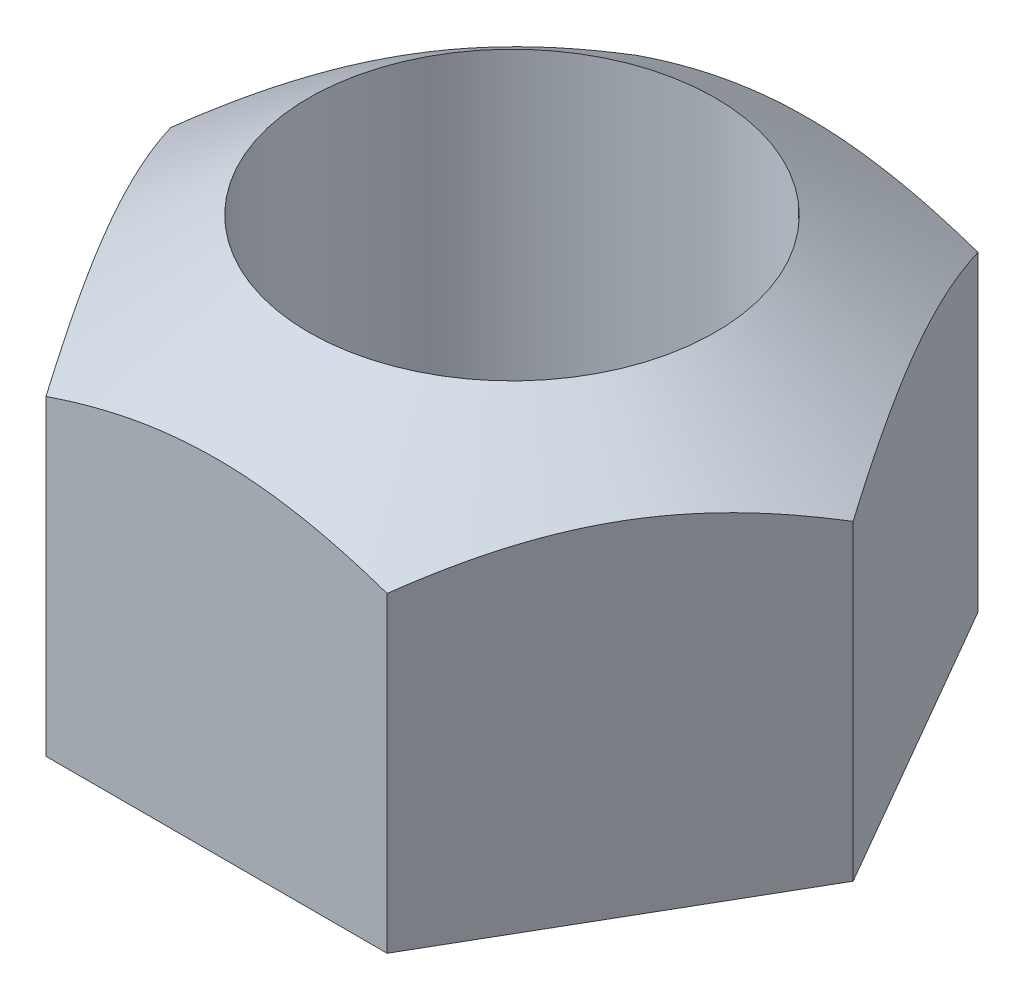
ISO-10303-21;
HEADER;
FILE_DESCRIPTION(('STEP AP214'),'2;1');
FILE_NAME('part.step','',(''),(''),'','','');
FILE_SCHEMA(('AUTOMOTIVE_DESIGN { 1 0 10303 214 1 1 1 1 }'));
ENDSEC;
DATA;
#1=APPLICATION_CONTEXT('core data for automotive mechanical design processes');
#2=APPLICATION_PROTOCOL_DEFINITION('international standard','automotive_design',2000,#1);
#3=PRODUCT_CONTEXT('',#1,'mechanical');
#4=PRODUCT('Part','Part','',(#3));
#5=PRODUCT_RELATED_PRODUCT_CATEGORY('part','',(#4));
#6=PRODUCT_DEFINITION_FORMATION('','',#4);
#7=PRODUCT_DEFINITION_CONTEXT('part definition',#1,'design');
#8=PRODUCT_DEFINITION('design','',#6,#7);
#9=PRODUCT_DEFINITION_SHAPE('','',#8);
#10=(LENGTH_UNIT() NAMED_UNIT(*) SI_UNIT(.MILLI.,.METRE.));
#11=(NAMED_UNIT(*) PLANE_ANGLE_UNIT() SI_UNIT($,.RADIAN.));
#12=(NAMED_UNIT(*) SI_UNIT($,.STERADIAN.) SOLID_ANGLE_UNIT());
#13=UNCERTAINTY_MEASURE_WITH_UNIT(LENGTH_MEASURE(1.E-05),#10,'distance_accuracy_value','');
#14=(GEOMETRIC_REPRESENTATION_CONTEXT(3) GLOBAL_UNCERTAINTY_ASSIGNED_CONTEXT((#13)) GLOBAL_UNIT_ASSIGNED_CONTEXT((#10,
#11,#12)) REPRESENTATION_CONTEXT('',''));
#15=CARTESIAN_POINT('',(0.,0.,0.));
#16=DIRECTION('',(0.,0.,1.));
#17=DIRECTION('',(1.,0.,0.));
#18=AXIS2_PLACEMENT_3D('',#15,#16,#17);
#19=CARTESIAN_POINT('',(0.730411307380375,2.31008644566849,1.26511069012455));
#20=DIRECTION('',(-0.866025403784442,0.,-0.499999999999995));
#21=DIRECTION('',(-0.499999999999995,0.,0.866025403784442));
#22=AXIS2_PLACEMENT_3D('',#19,#20,#21);
#23=PLANE('',#22);
#24=CARTESIAN_POINT('',(0.730344334749149,1.90459442003512,1.26522669012455));
#25=CARTESIAN_POINT('',(0.762994849035526,1.92700671426747,1.20867434048729));
#26=CARTESIAN_POINT('',(0.796043354908079,1.94743841424387,1.15143264920179));
#27=CARTESIAN_POINT('',(0.862961564355046,1.983056341439,1.0355269104881));
#28=CARTESIAN_POINT('',(0.896833844074278,1.99822297281167,0.976858401046209));
#29=CARTESIAN_POINT('',(0.963984480609225,2.021427267074,0.860550086807088));
#30=CARTESIAN_POINT('',(0.997242011803791,2.0296962717228,0.802946353043791));
#31=CARTESIAN_POINT('',(1.06395417871489,2.03904799498006,0.687397490470748));
#32=CARTESIAN_POINT('',(1.09740831219659,2.04014450705557,0.629453231557254));
#33=CARTESIAN_POINT('',(1.15852067768774,2.03549590271579,0.523603509555858));
#34=CARTESIAN_POINT('',(1.186202315196,2.03087642950622,0.475657506954846));
#35=CARTESIAN_POINT('',(1.2412759293787,2.01700190697536,0.38026720903396));
#36=CARTESIAN_POINT('',(1.26866783154976,2.00774569358291,0.332823042757741));
#37=CARTESIAN_POINT('',(1.32386692363268,1.98488627164974,0.237215410738445));
#38=CARTESIAN_POINT('',(1.35166076296746,1.97115749351571,0.189075068873205));
#39=CARTESIAN_POINT('',(1.40668476888355,1.94026109875597,0.093770694990564));
#40=CARTESIAN_POINT('',(1.43391631770764,1.92310340762198,0.0466042688584459));
#41=CARTESIAN_POINT('',(1.46089027750967,1.90459442003512,-0.000115999999999781));
#42=B_SPLINE_CURVE_WITH_KNOTS('',3,(#24,#25,#26,#27,#28,#29,#30,#31,#32,#33,#34,#35,#36,#37,#38,
#39,#40,#41),.UNSPECIFIED.,.F.,.F.,(4,2,2,2,2,2,2,2,4),(0.,0.207256785975081,0.415276884264073,
0.616002323096558,0.816341631759163,0.9828011365583,1.14930245260552,1.3209524248478,
1.4921125460658),.UNSPECIFIED.);
#43=CARTESIAN_POINT('',(0.730411307380375,1.90464038238119,1.26511069012455));
#44=VERTEX_POINT('',#43);
#45=CARTESIAN_POINT('',(1.46082330487845,1.90464038238119,0.));
#46=VERTEX_POINT('',#45);
#47=EDGE_CURVE('E87',#44,#46,#42,.T.);
#48=ORIENTED_EDGE('',*,*,#47,.F.);
#49=DIRECTION('',(0.,-1.,0.));
#50=VECTOR('',#49,1.);
#51=CARTESIAN_POINT('',(0.730411307380375,2.31008644566849,1.26511069012455));
#52=LINE('',#51,#50);
#53=CARTESIAN_POINT('',(0.730411307380375,0.570086445668492,1.26511069012455));
#54=VERTEX_POINT('',#53);
#55=EDGE_CURVE('E57',#44,#54,#52,.T.);
#56=ORIENTED_EDGE('',*,*,#55,.T.);
#57=DIRECTION('',(0.499999999999995,0.,-0.866025403784441));
#58=VECTOR('',#57,1.);
#59=CARTESIAN_POINT('',(0.730411307380375,0.570086445668492,1.26511069012455));
#60=LINE('',#59,#58);
#61=CARTESIAN_POINT('',(1.46082330487845,0.570086445668492,0.));
#62=VERTEX_POINT('',#61);
#63=EDGE_CURVE('E127',#54,#62,#60,.T.);
#64=ORIENTED_EDGE('',*,*,#63,.T.);
#65=DIRECTION('',(0.,-1.,0.));
#66=VECTOR('',#65,1.);
#67=CARTESIAN_POINT('',(1.46082330487845,2.31008644566849,0.));
#68=LINE('',#67,#66);
#69=EDGE_CURVE('E11',#46,#62,#68,.T.);
#70=ORIENTED_EDGE('',*,*,#69,.F.);
#71=EDGE_LOOP('',(#48,#56,#64,#70));
#72=FACE_BOUND('',#71,.T.);
#73=ADVANCED_FACE('F34',(#72),#23,.F.);
#74=CARTESIAN_POINT('',(1.46082330487845,2.31008644566849,0.));
#75=DIRECTION('',(-0.866025403784438,0.,0.500000000000001));
#76=DIRECTION('',(0.500000000000001,0.,0.866025403784438));
#77=AXIS2_PLACEMENT_3D('',#74,#75,#76);
#78=PLANE('',#77);
#79=CARTESIAN_POINT('',(1.46089027750967,1.90459442003512,0.000116000000000267));
#80=CARTESIAN_POINT('',(1.42823976322329,1.92700671426747,-0.0564363496372581));
#81=CARTESIAN_POINT('',(1.39519125735074,1.94743841424387,-0.113678040922759));
#82=CARTESIAN_POINT('',(1.32827304790377,1.983056341439,-0.229583779636442));
#83=CARTESIAN_POINT('',(1.29440076818454,1.99822297281167,-0.288252289078337));
#84=CARTESIAN_POINT('',(1.22725013164959,2.021427267074,-0.404560603317457));
#85=CARTESIAN_POINT('',(1.19399260045503,2.02969627172281,-0.462164337080754));
#86=CARTESIAN_POINT('',(1.12728043354393,2.03904799498006,-0.577713199653796));
#87=CARTESIAN_POINT('',(1.09382630006223,2.04014450705557,-0.635657458567289));
#88=CARTESIAN_POINT('',(1.03271393457107,2.03549590271579,-0.741507180568686));
#89=CARTESIAN_POINT('',(1.00503229706281,2.03087642950622,-0.789453183169699));
#90=CARTESIAN_POINT('',(0.949958682880108,2.01700190697536,-0.884843481090588));
#91=CARTESIAN_POINT('',(0.922566780709055,2.00774569358291,-0.932287647366807));
#92=CARTESIAN_POINT('',(0.86736768862613,1.98488627164974,-1.02789527938611));
#93=CARTESIAN_POINT('',(0.839573849291352,1.97115749351571,-1.07603562125135));
#94=CARTESIAN_POINT('',(0.784549843375259,1.94026109875597,-1.17133999513399));
#95=CARTESIAN_POINT('',(0.757318294551168,1.92310340762198,-1.21850642126611));
#96=CARTESIAN_POINT('',(0.730344334749132,1.90459442003512,-1.26522669012456));
#97=B_SPLINE_CURVE_WITH_KNOTS('',3,(#79,#80,#81,#82,#83,#84,#85,#86,#87,#88,#89,#90,#91,#92,#93,
#94,#95,#96),.UNSPECIFIED.,.F.,.F.,(4,2,2,2,2,2,2,2,4),(0.,0.207256785975081,0.415276884264073,
0.616002323096558,0.816341631759162,0.982801136558304,1.14930245260553,1.32095242484782,
1.49211254606581),.UNSPECIFIED.);
#98=CARTESIAN_POINT('',(0.730411307380358,1.90464038238119,-1.26511069012456));
#99=VERTEX_POINT('',#98);
#100=EDGE_CURVE('E95',#46,#99,#97,.T.);
#101=ORIENTED_EDGE('',*,*,#100,.F.);
#102=ORIENTED_EDGE('',*,*,#69,.T.);
#103=DIRECTION('',(-0.500000000000001,0.,-0.866025403784438));
#104=VECTOR('',#103,1.);
#105=CARTESIAN_POINT('',(1.46082330487845,0.570086445668492,0.));
#106=LINE('',#105,#104);
#107=CARTESIAN_POINT('',(0.730411307380358,0.570086445668492,-1.26511069012456));
#108=VERTEX_POINT('',#107);
#109=EDGE_CURVE('E124',#62,#108,#106,.T.);
#110=ORIENTED_EDGE('',*,*,#109,.T.);
#111=DIRECTION('',(0.,-1.,0.));
#112=VECTOR('',#111,1.);
#113=CARTESIAN_POINT('',(0.730411307380358,2.31008644566849,-1.26511069012456));
#114=LINE('',#113,#112);
#115=EDGE_CURVE('E42',#99,#108,#114,.T.);
#116=ORIENTED_EDGE('',*,*,#115,.F.);
#117=EDGE_LOOP('',(#101,#102,#110,#116));
#118=FACE_BOUND('',#117,.T.);
#119=ADVANCED_FACE('F125',(#118),#78,.F.);
#120=CARTESIAN_POINT('',(0.730411307380358,2.31008644566849,-1.26511069012456));
#121=DIRECTION('',(0.,0.,1.));
#122=DIRECTION('',(1.,0.,0.));
#123=AXIS2_PLACEMENT_3D('',#120,#121,#122);
#124=PLANE('',#123);
#125=CARTESIAN_POINT('',(-1.71363681046105,1.44540139064842,-1.26511069012455));
#126=CARTESIAN_POINT('',(-1.6666089797108,1.47135820230091,-1.26511069012455));
#127=CARTESIAN_POINT('',(-1.61942523065414,1.49703694142713,-1.26511069012455));
#128=CARTESIAN_POINT('',(-1.52467279271376,1.54769703594125,-1.26511069012455));
#129=CARTESIAN_POINT('',(-1.47710402667997,1.57267824685973,-1.26511069012455));
#130=CARTESIAN_POINT('',(-1.38122425928571,1.62194719808813,-1.26511069012455));
#131=CARTESIAN_POINT('',(-1.3329104627545,1.64622952705724,-1.26511069012455));
#132=CARTESIAN_POINT('',(-1.23576265994052,1.69372158184219,-1.26511069012455));
#133=CARTESIAN_POINT('',(-1.18692868319917,1.71693136817311,-1.26511069012455));
#134=CARTESIAN_POINT('',(-1.03628357482214,1.78607701873522,-1.26511069012455));
#135=CARTESIAN_POINT('',(-0.933470956989689,1.82987509258553,-1.26511069012455));
#136=CARTESIAN_POINT('',(-0.724576630891701,1.90842346007959,-1.26511069012455));
#137=CARTESIAN_POINT('',(-0.618504317680191,1.94319744579488,-1.26511069012455));
#138=CARTESIAN_POINT('',(-0.451817153443067,1.98599678211792,-1.26511069012455));
#139=CARTESIAN_POINT('',(-0.392494446163903,1.99899217293489,-1.26511069012455));
#140=CARTESIAN_POINT('',(-0.272940169228112,2.0198568455114,-1.26511069012455));
#141=CARTESIAN_POINT('',(-0.212708770947646,2.02772708179281,-1.26511069012455));
#142=CARTESIAN_POINT('',(-0.0926609144173519,2.03756601528617,-1.26511069012455));
#143=CARTESIAN_POINT('',(-0.0328517499757665,2.03962132561417,-1.26511069012455));
#144=CARTESIAN_POINT('',(0.0866838660549695,2.03787842201897,-1.26511069012455));
#145=CARTESIAN_POINT('',(0.146410306561648,2.03407948784457,-1.26511069012455));
#146=CARTESIAN_POINT('',(0.27789263138173,2.01958907772609,-1.26511069012456));
#147=CARTESIAN_POINT('',(0.349504148305075,2.00760306060661,-1.26511069012456));
#148=CARTESIAN_POINT('',(0.491288746248722,1.97693307888654,-1.26511069012456));
#149=CARTESIAN_POINT('',(0.561460475884036,1.9582431010076,-1.26511069012456));
#150=CARTESIAN_POINT('',(0.701850522374415,1.91525494889421,-1.26511069012456));
#151=CARTESIAN_POINT('',(0.772030676011676,1.89083457090076,-1.26511069012456));
#152=CARTESIAN_POINT('',(0.876146089892861,1.85126365136414,-1.26511069012456));
#153=CARTESIAN_POINT('',(0.910655681776702,1.83758465961976,-1.26511069012456));
#154=CARTESIAN_POINT('',(0.979333669314093,1.80938048431248,-1.26511069012456));
#155=CARTESIAN_POINT('',(1.01350201769018,1.79485518535227,-1.26511069012456));
#156=CARTESIAN_POINT('',(1.10642372986043,1.75418926740721,-1.26511069012456));
#157=CARTESIAN_POINT('',(1.1648623524846,1.72733028170191,-1.26511069012456));
#158=CARTESIAN_POINT('',(1.28095334020165,1.67195830549759,-1.26511069012456));
#159=CARTESIAN_POINT('',(1.33860559895701,1.64344509398858,-1.26511069012456));
#160=CARTESIAN_POINT('',(1.51063708262007,1.5559820193895,-1.26511069012456));
#161=CARTESIAN_POINT('',(1.62404645796107,1.49512894306785,-1.26511069012456));
#162=CARTESIAN_POINT('',(1.84933809110043,1.37015521457951,-1.26511069012456));
#163=CARTESIAN_POINT('',(1.96121660048732,1.30602790682887,-1.26511069012456));
#164=CARTESIAN_POINT('',(2.18375399972391,1.17567964078263,-1.26511069012456));
#165=CARTESIAN_POINT('',(2.29441280516911,1.10945853880634,-1.26511069012456));
#166=CARTESIAN_POINT('',(2.50270849347165,0.982954302664846,-1.26511069012456));
#167=CARTESIAN_POINT('',(2.60043671055914,0.9228208717716,-1.26511069012456));
#168=CARTESIAN_POINT('',(2.79537326080928,0.801702652016759,-1.26511069012456));
#169=CARTESIAN_POINT('',(2.89258155636159,0.740717802686764,-1.26511069012456));
#170=CARTESIAN_POINT('',(3.08612860935584,0.618400508381204,-1.26511069012457));
#171=CARTESIAN_POINT('',(3.1824693020151,0.557071120194004,-1.26511069012457));
#172=CARTESIAN_POINT('',(3.37482010905709,0.433917232566977,-1.26511069012457));
#173=CARTESIAN_POINT('',(3.47083025594729,0.372092783925148,-1.26511069012457));
#174=CARTESIAN_POINT('',(3.5667204835218,0.310084337105674,-1.26511069012457));
#175=B_SPLINE_CURVE_WITH_KNOTS('',3,(#125,#126,#127,#128,#129,#130,#131,#132,#133,#134,#135,
#136,#137,#138,#139,#140,#141,#142,#143,#144,#145,#146,#147,#148,#149,#150,#151,#152,#153,#154,
#155,#156,#157,#158,#159,#160,#161,#162,#163,#164,#165,#166,#167,#168,#169,#170,#171,#172,#173,
#174),.UNSPECIFIED.,.F.,.F.,(4,2,2,2,2,2,2,2,2,2,2,2,2,2,2,2,2,2,2,2,2,2,2,2,4),(0.,
0.161149087075127,0.322331306828059,0.484537113022617,0.646733756026832,0.981766587550142,
1.31591070697251,1.49791679776368,1.67988898157347,1.85913605247545,2.03840517801243,
2.25581728968302,2.47342490403572,2.696180027428,2.80753739742604,2.91890998713689,
3.11181935700755,3.30475455982076,3.69077161173963,4.07760725341118,4.46446949844381,
4.80870508313862,5.15296524135169,5.49557914250136,5.83815832748947),.UNSPECIFIED.);
#176=CARTESIAN_POINT('',(-0.730412687615816,1.90464038238119,-1.26511069012455));
#177=VERTEX_POINT('',#176);
#178=EDGE_CURVE('E121',#99,#177,#175,.F.);
#179=ORIENTED_EDGE('',*,*,#178,.F.);
#180=ORIENTED_EDGE('',*,*,#115,.T.);
#181=DIRECTION('',(-1.,0.,0.));
#182=VECTOR('',#181,1.);
#183=CARTESIAN_POINT('',(0.730411307380358,0.570086445668492,-1.26511069012456));
#184=LINE('',#183,#182);
#185=CARTESIAN_POINT('',(-0.730412687615816,0.570086445668492,-1.26511069012455));
#186=VERTEX_POINT('',#185);
#187=EDGE_CURVE('E119',#108,#186,#184,.T.);
#188=ORIENTED_EDGE('',*,*,#187,.T.);
#189=DIRECTION('',(0.,-1.,0.));
#190=VECTOR('',#189,1.);
#191=CARTESIAN_POINT('',(-0.730412687615816,2.31008644566849,-1.26511069012455));
#192=LINE('',#191,#190);
#193=EDGE_CURVE('E110',#177,#186,#192,.T.);
#194=ORIENTED_EDGE('',*,*,#193,.F.);
#195=EDGE_LOOP('',(#179,#180,#188,#194));
#196=FACE_BOUND('',#195,.T.);
#197=ADVANCED_FACE('F116',(#196),#124,.F.);
#198=CARTESIAN_POINT('',(-0.730412687615816,2.31008644566849,-1.26511069012455));
#199=DIRECTION('',(0.866025403784441,0.,0.499999999999995));
#200=DIRECTION('',(0.499999999999995,0.,-0.866025403784442));
#201=AXIS2_PLACEMENT_3D('',#198,#199,#200);
#202=PLANE('',#201);
#203=CARTESIAN_POINT('',(-0.73034571498459,1.90459442003512,-1.26522669012455));
#204=CARTESIAN_POINT('',(-0.762996229270966,1.92700671426747,-1.20867434048729));
#205=CARTESIAN_POINT('',(-0.796044735143519,1.94743841424387,-1.15143264920179));
#206=CARTESIAN_POINT('',(-0.862962944590486,1.98305634143901,-1.03552691048811));
#207=CARTESIAN_POINT('',(-0.896835224309718,1.99822297281167,-0.976858401046214));
#208=CARTESIAN_POINT('',(-0.963985860844665,2.021427267074,-0.860550086807093));
#209=CARTESIAN_POINT('',(-0.997243392039232,2.02969627172281,-0.802946353043796));
#210=CARTESIAN_POINT('',(-1.06395555895033,2.03904799498006,-0.687397490470753));
#211=CARTESIAN_POINT('',(-1.09740969243203,2.04014450705557,-0.629453231557259));
#212=CARTESIAN_POINT('',(-1.15852205792318,2.03549590271579,-0.523603509555862));
#213=CARTESIAN_POINT('',(-1.18620369543144,2.03087642950622,-0.475657506954849));
#214=CARTESIAN_POINT('',(-1.24127730961415,2.01700190697536,-0.38026720903396));
#215=CARTESIAN_POINT('',(-1.2686692117852,2.00774569358291,-0.33282304275774));
#216=CARTESIAN_POINT('',(-1.32386830386812,1.98488627164974,-0.237215410738441));
#217=CARTESIAN_POINT('',(-1.3516621432029,1.97115749351571,-0.1890750688732));
#218=CARTESIAN_POINT('',(-1.40668614911899,1.94026109875597,-0.0937706949905561));
#219=CARTESIAN_POINT('',(-1.43391769794309,1.92310340762198,-0.0466042688584367));
#220=CARTESIAN_POINT('',(-1.46089165774512,1.90459442003512,0.000116000000010308));
#221=B_SPLINE_CURVE_WITH_KNOTS('',3,(#203,#204,#205,#206,#207,#208,#209,#210,#211,#212,#213,
#214,#215,#216,#217,#218,#219,#220),.UNSPECIFIED.,.F.,.F.,(4,2,2,2,2,2,2,2,4),(0.,
0.207256785975081,0.415276884264073,0.616002323096558,0.816341631759163,0.982801136558305,
1.14930245260553,1.32095242484782,1.49211254606581),.UNSPECIFIED.);
#222=CARTESIAN_POINT('',(-1.4608246851139,1.90464038238119,0.));
#223=VERTEX_POINT('',#222);
#224=EDGE_CURVE('E178',#177,#223,#221,.T.);
#225=ORIENTED_EDGE('',*,*,#224,.F.);
#226=ORIENTED_EDGE('',*,*,#193,.T.);
#227=DIRECTION('',(-0.499999999999995,0.,0.866025403784442));
#228=VECTOR('',#227,1.);
#229=CARTESIAN_POINT('',(-0.730412687615816,0.570086445668492,-1.26511069012455));
#230=LINE('',#229,#228);
#231=CARTESIAN_POINT('',(-1.4608246851139,0.570086445668492,0.));
#232=VERTEX_POINT('',#231);
#233=EDGE_CURVE('E133',#186,#232,#230,.T.);
#234=ORIENTED_EDGE('',*,*,#233,.T.);
#235=DIRECTION('',(0.,-1.,0.));
#236=VECTOR('',#235,1.);
#237=CARTESIAN_POINT('',(-1.4608246851139,2.31008644566849,0.));
#238=LINE('',#237,#236);
#239=EDGE_CURVE('E103',#223,#232,#238,.T.);
#240=ORIENTED_EDGE('',*,*,#239,.F.);
#241=EDGE_LOOP('',(#225,#226,#234,#240));
#242=FACE_BOUND('',#241,.T.);
#243=ADVANCED_FACE('F191',(#242),#202,.F.);
#244=CARTESIAN_POINT('',(-1.4608246851139,2.31008644566849,0.));
#245=DIRECTION('',(0.866025403784434,0.,-0.500000000000007));
#246=DIRECTION('',(-0.500000000000007,0.,-0.866025403784435));
#247=AXIS2_PLACEMENT_3D('',#244,#245,#246);
#248=PLANE('',#247);
#249=CARTESIAN_POINT('',(-1.46089165774512,1.90459442003512,-0.000115999999989534));
#250=CARTESIAN_POINT('',(-1.42824114345874,1.92700671426747,0.0564363496372685));
#251=CARTESIAN_POINT('',(-1.39519263758619,1.94743841424387,0.113678040922769));
#252=CARTESIAN_POINT('',(-1.32827442813922,1.983056341439,0.229583779636451));
#253=CARTESIAN_POINT('',(-1.29440214841999,1.99822297281167,0.288252289078346));
#254=CARTESIAN_POINT('',(-1.22725151188504,2.021427267074,0.404560603317466));
#255=CARTESIAN_POINT('',(-1.19399398069047,2.02969627172281,0.462164337080763));
#256=CARTESIAN_POINT('',(-1.12728181377937,2.03904799498006,0.577713199653804));
#257=CARTESIAN_POINT('',(-1.09382768029767,2.04014450705557,0.635657458567297));
#258=CARTESIAN_POINT('',(-1.03271531480652,2.03549590271579,0.741507180568694));
#259=CARTESIAN_POINT('',(-1.00503367729826,2.03087642950622,0.789453183169707));
#260=CARTESIAN_POINT('',(-0.949960063115551,2.01700190697536,0.884843481090595));
#261=CARTESIAN_POINT('',(-0.922568160944498,2.00774569358291,0.932287647366814));
#262=CARTESIAN_POINT('',(-0.867369068861572,1.98488627164974,1.02789527938611));
#263=CARTESIAN_POINT('',(-0.839575229526794,1.97115749351571,1.07603562125135));
#264=CARTESIAN_POINT('',(-0.784551223610701,1.94026109875597,1.171339995134));
#265=CARTESIAN_POINT('',(-0.757319674786609,1.92310340762198,1.21850642126612));
#266=CARTESIAN_POINT('',(-0.730345714984572,1.90459442003512,1.26522669012456));
#267=B_SPLINE_CURVE_WITH_KNOTS('',3,(#249,#250,#251,#252,#253,#254,#255,#256,#257,#258,#259,
#260,#261,#262,#263,#264,#265,#266),.UNSPECIFIED.,.F.,.F.,(4,2,2,2,2,2,2,2,4),(0.,
0.207256785975081,0.415276884264073,0.616002323096558,0.816341631759162,0.982801136558304,
1.14930245260553,1.32095242484782,1.49211254606581),.UNSPECIFIED.);
#268=CARTESIAN_POINT('',(-0.730412687615798,1.90464038238119,1.26511069012456));
#269=VERTEX_POINT('',#268);
#270=EDGE_CURVE('E49',#223,#269,#267,.T.);
#271=ORIENTED_EDGE('',*,*,#270,.F.);
#272=ORIENTED_EDGE('',*,*,#239,.T.);
#273=DIRECTION('',(0.500000000000007,0.,0.866025403784434));
#274=VECTOR('',#273,1.);
#275=CARTESIAN_POINT('',(-1.4608246851139,0.570086445668492,0.));
#276=LINE('',#275,#274);
#277=CARTESIAN_POINT('',(-0.730412687615798,0.570086445668492,1.26511069012456));
#278=VERTEX_POINT('',#277);
#279=EDGE_CURVE('E105',#232,#278,#276,.T.);
#280=ORIENTED_EDGE('',*,*,#279,.T.);
#281=DIRECTION('',(0.,-1.,0.));
#282=VECTOR('',#281,1.);
#283=CARTESIAN_POINT('',(-0.730412687615798,2.31008644566849,1.26511069012456));
#284=LINE('',#283,#282);
#285=EDGE_CURVE('E101',#269,#278,#284,.T.);
#286=ORIENTED_EDGE('',*,*,#285,.F.);
#287=EDGE_LOOP('',(#271,#272,#280,#286));
#288=FACE_BOUND('',#287,.T.);
#289=ADVANCED_FACE('F139',(#288),#248,.F.);
#290=CARTESIAN_POINT('',(-0.730412687615798,2.31008644566849,1.26511069012456));
#291=DIRECTION('',(0.,0.,-1.));
#292=DIRECTION('',(-1.,0.,0.));
#293=AXIS2_PLACEMENT_3D('',#290,#291,#292);
#294=PLANE('',#293);
#295=CARTESIAN_POINT('',(-1.71363681103067,1.44540139033393,1.26511069012457));
#296=CARTESIAN_POINT('',(-1.66660898026274,1.47135820199923,1.26511069012457));
#297=CARTESIAN_POINT('',(-1.61942523118838,1.49703694113823,1.26511069012457));
#298=CARTESIAN_POINT('',(-1.52467279321251,1.54769703567787,1.26511069012457));
#299=CARTESIAN_POINT('',(-1.47710402716094,1.57267824660907,1.26511069012457));
#300=CARTESIAN_POINT('',(-1.38122425973066,1.62194719786299,1.26511069012457));
#301=CARTESIAN_POINT('',(-1.33291046318121,1.6462295268449,1.26511069012457));
#302=CARTESIAN_POINT('',(-1.23576266033056,1.69372158165521,1.26511069012457));
#303=CARTESIAN_POINT('',(-1.18692868357078,1.7169313679987,1.26511069012457));
#304=CARTESIAN_POINT('',(-1.03628357513285,1.78607701860064,1.26511069012457));
#305=CARTESIAN_POINT('',(-0.933470957257395,1.82987509247742,1.26511069012456));
#306=CARTESIAN_POINT('',(-0.724576631071095,1.90842346001951,1.26511069012456));
#307=CARTESIAN_POINT('',(-0.618504317814295,1.94319744575638,1.26511069012456));
#308=CARTESIAN_POINT('',(-0.451817153549077,1.9859967820929,1.26511069012456));
#309=CARTESIAN_POINT('',(-0.392494446289105,1.99899217290879,1.26511069012456));
#310=CARTESIAN_POINT('',(-0.272940169391996,2.01985684548703,1.26511069012456));
#311=CARTESIAN_POINT('',(-0.21270877113102,2.02772708177126,1.26511069012456));
#312=CARTESIAN_POINT('',(-0.0926609146393876,2.03756601527437,1.26511069012456));
#313=CARTESIAN_POINT('',(-0.0328517502169801,2.03962132560927,1.26511069012456));
#314=CARTESIAN_POINT('',(0.0866838657762762,2.03787842203146,1.26511069012455));
#315=CARTESIAN_POINT('',(0.146410306264653,2.03407948786755,1.26511069012455));
#316=CARTESIAN_POINT('',(0.277892631041122,2.01958907777545,1.26511069012455));
#317=CARTESIAN_POINT('',(0.349504147939494,2.00760306067293,1.26511069012455));
#318=CARTESIAN_POINT('',(0.491288745834858,1.9769330789889,1.26511069012455));
#319=CARTESIAN_POINT('',(0.561460475446864,1.95824310112907,1.26511069012455));
#320=CARTESIAN_POINT('',(0.701850521891027,1.91525494905495,1.26511069012455));
#321=CARTESIAN_POINT('',(0.772030675505412,1.89083457108167,1.26511069012455));
#322=CARTESIAN_POINT('',(0.876146089352739,1.85126365157516,1.26511069012455));
#323=CARTESIAN_POINT('',(0.910655681225381,1.83758465984079,1.26511069012455));
#324=CARTESIAN_POINT('',(0.979333668740466,1.80938048455345,1.26511069012454));
#325=CARTESIAN_POINT('',(1.01350201710545,1.79485518560316,1.26511069012454));
#326=CARTESIAN_POINT('',(1.10642372926946,1.75418926767456,1.26511069012454));
#327=CARTESIAN_POINT('',(1.16486235189817,1.7273302819748,1.26511069012454));
#328=CARTESIAN_POINT('',(1.28095333962379,1.67195830578001,1.26511069012454));
#329=CARTESIAN_POINT('',(1.33860559838317,1.64344509427501,1.26511069012454));
#330=CARTESIAN_POINT('',(1.51063708205769,1.55598201968622,1.26511069012454));
#331=CARTESIAN_POINT('',(1.62404645740546,1.49512894336919,1.26511069012454));
#332=CARTESIAN_POINT('',(1.84933809055759,1.37015521488747,1.26511069012454));
#333=CARTESIAN_POINT('',(1.96121659995046,1.3060279071388,1.26511069012453));
#334=CARTESIAN_POINT('',(2.18375399919825,1.17567964109508,1.26511069012453));
#335=CARTESIAN_POINT('',(2.29441280464867,1.10945853911932,1.26511069012453));
#336=CARTESIAN_POINT('',(2.5027084929568,0.982954302980295,1.26511069012453));
#337=CARTESIAN_POINT('',(2.60043671004475,0.922820872089133,1.26511069012453));
#338=CARTESIAN_POINT('',(2.79537326029556,0.801702652338033,1.26511069012453));
#339=CARTESIAN_POINT('',(2.8925815558481,0.740717803009697,1.26511069012453));
#340=CARTESIAN_POINT('',(3.08612860884188,0.618400508707619,1.26511069012452));
#341=CARTESIAN_POINT('',(3.18246930150046,0.55707112052225,1.26511069012452));
#342=CARTESIAN_POINT('',(3.37482010854095,0.43391723289869,1.26511069012452));
#343=CARTESIAN_POINT('',(3.47083025543033,0.372092784258498,1.26511069012452));
#344=CARTESIAN_POINT('',(3.56672048300398,0.310084337440595,1.26511069012452));
#345=B_SPLINE_CURVE_WITH_KNOTS('',3,(#295,#296,#297,#298,#299,#300,#301,#302,#303,#304,#305,
#306,#307,#308,#309,#310,#311,#312,#313,#314,#315,#316,#317,#318,#319,#320,#321,#322,#323,#324,
#325,#326,#327,#328,#329,#330,#331,#332,#333,#334,#335,#336,#337,#338,#339,#340,#341,#342,#343,
#344),.UNSPECIFIED.,.F.,.F.,(4,2,2,2,2,2,2,2,2,2,2,2,2,2,2,2,2,2,2,2,2,2,2,2,4),(0.,
0.161149087140106,0.32233130695803,0.484537113218708,0.646733756289036,0.981766587962143,
1.31591070753301,1.49791679826746,1.67988898202066,1.85913605286616,2.03840517834656,
2.2558172899351,2.4734249042055,2.69618002751303,2.80753739746876,2.91890998713729,
3.11181935701333,3.30475455983199,3.69077161176207,4.07760725344619,4.46446949849143,
4.80870508318411,5.1529652413951,5.4955791425401,5.83815832752348),.UNSPECIFIED.);
#346=EDGE_CURVE('E85',#269,#44,#345,.T.);
#347=ORIENTED_EDGE('',*,*,#346,.F.);
#348=ORIENTED_EDGE('',*,*,#285,.T.);
#349=DIRECTION('',(1.,0.,0.));
#350=VECTOR('',#349,1.);
#351=CARTESIAN_POINT('',(-0.730412687615798,0.570086445668492,1.26511069012456));
#352=LINE('',#351,#350);
#353=EDGE_CURVE('E99',#278,#54,#352,.T.);
#354=ORIENTED_EDGE('',*,*,#353,.T.);
#355=ORIENTED_EDGE('',*,*,#55,.F.);
#356=EDGE_LOOP('',(#347,#348,#354,#355));
#357=FACE_BOUND('',#356,.T.);
#358=ADVANCED_FACE('F97',(#357),#294,.F.);
#359=CARTESIAN_POINT('',(-6.90117724671566E-07,0.570086445668492,0.));
#360=DIRECTION('',(0.,1.,0.));
#361=DIRECTION('',(0.,0.,1.));
#362=AXIS2_PLACEMENT_3D('',#359,#360,#361);
#363=PLANE('',#362);
#364=ORIENTED_EDGE('',*,*,#63,.F.);
#365=ORIENTED_EDGE('',*,*,#353,.F.);
#366=ORIENTED_EDGE('',*,*,#279,.F.);
#367=ORIENTED_EDGE('',*,*,#233,.F.);
#368=ORIENTED_EDGE('',*,*,#187,.F.);
#369=ORIENTED_EDGE('',*,*,#109,.F.);
#370=EDGE_LOOP('',(#364,#365,#366,#367,#368,#369));
#371=FACE_BOUND('',#370,.T.);
#372=CARTESIAN_POINT('',(-6.90117724671566E-07,0.570086445668492,0.));
#373=DIRECTION('',(0.,1.,0.));
#374=DIRECTION('',(0.,0.,1.));
#375=AXIS2_PLACEMENT_3D('',#372,#373,#374);
#376=CIRCLE('',#375,0.87);
#377=CARTESIAN_POINT('',(-6.90117724671566E-07,0.570086445668492,0.87));
#378=VERTEX_POINT('',#377);
#379=EDGE_CURVE('E94',#378,#378,#376,.T.);
#380=ORIENTED_EDGE('',*,*,#379,.T.);
#381=EDGE_LOOP('',(#380));
#382=FACE_BOUND('',#381,.T.);
#383=ADVANCED_FACE('F129',(#371,#382),#363,.F.);
#384=CARTESIAN_POINT('',(-6.90117724671566E-07,2.31008644566849,0.));
#385=DIRECTION('',(0.,-1.,0.));
#386=DIRECTION('',(0.,0.,-1.));
#387=AXIS2_PLACEMENT_3D('',#384,#385,#386);
#388=CYLINDRICAL_SURFACE('',#387,0.87);
#389=CARTESIAN_POINT('',(-6.90117724671566E-07,2.31008644566849,0.));
#390=DIRECTION('',(0.,1.,0.));
#391=DIRECTION('',(0.,0.,1.));
#392=AXIS2_PLACEMENT_3D('',#389,#390,#391);
#393=CIRCLE('',#392,0.87);
#394=CARTESIAN_POINT('',(-6.90117724671566E-07,2.31008644566849,0.87));
#395=VERTEX_POINT('',#394);
#396=EDGE_CURVE('E91',#395,#395,#393,.T.);
#397=ORIENTED_EDGE('',*,*,#396,.T.);
#398=EDGE_LOOP('',(#397));
#399=FACE_BOUND('',#398,.T.);
#400=ORIENTED_EDGE('',*,*,#379,.F.);
#401=EDGE_LOOP('',(#400));
#402=FACE_BOUND('',#401,.T.);
#403=ADVANCED_FACE('F157',(#399,#402),#388,.F.);
#404=CARTESIAN_POINT('',(-6.90117724671566E-07,2.31008644566849,0.));
#405=DIRECTION('',(0.,-1.,0.));
#406=DIRECTION('',(0.,0.,-1.));
#407=AXIS2_PLACEMENT_3D('',#404,#405,#406);
#408=CONICAL_SURFACE('',#407,0.87,0.969366225809016);
#409=ORIENTED_EDGE('',*,*,#396,.F.);
#410=EDGE_LOOP('',(#409));
#411=FACE_BOUND('',#410,.T.);
#412=ORIENTED_EDGE('',*,*,#47,.T.);
#413=ORIENTED_EDGE('',*,*,#100,.T.);
#414=ORIENTED_EDGE('',*,*,#178,.T.);
#415=ORIENTED_EDGE('',*,*,#224,.T.);
#416=ORIENTED_EDGE('',*,*,#270,.T.);
#417=ORIENTED_EDGE('',*,*,#346,.T.);
#418=EDGE_LOOP('',(#412,#413,#414,#415,#416,#417));
#419=FACE_BOUND('',#418,.T.);
#420=ADVANCED_FACE('F86',(#411,#419),#408,.T.);
#421=CLOSED_SHELL('',(#73,#119,#197,#243,#289,#358,#383,#403,#420));
#422=MANIFOLD_SOLID_BREP('B2',#421);
#423=ADVANCED_BREP_SHAPE_REPRESENTATION('',(#18,#422),#14);
#424=SHAPE_DEFINITION_REPRESENTATION(#9,#423);
ENDSEC;
END-ISO-10303-21;
